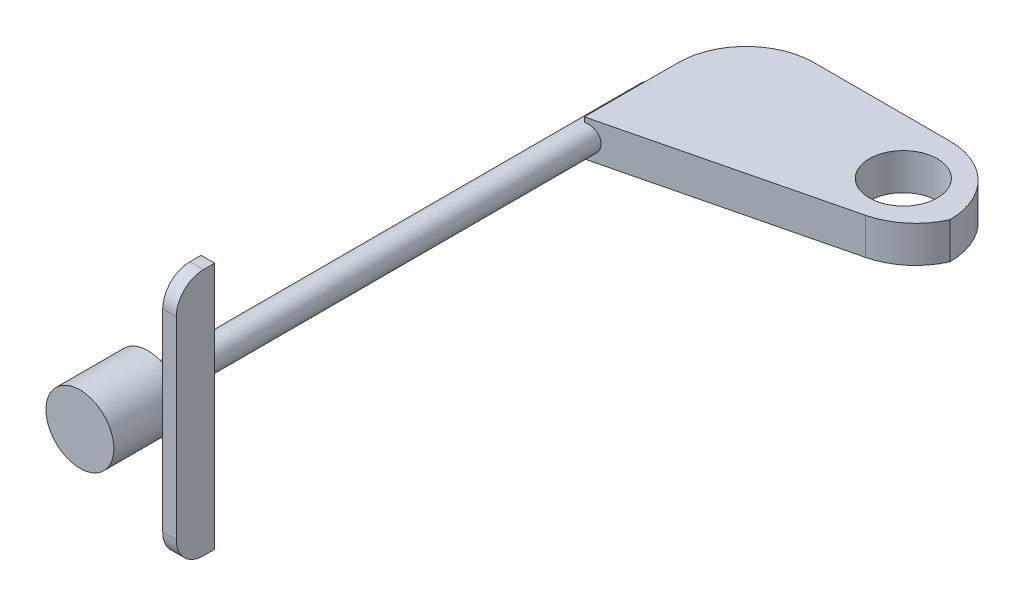
ISO-10303-21;
HEADER;
FILE_DESCRIPTION(('STEP AP214'),'2;1');
FILE_NAME('part.step','',(''),(''),'','','');
FILE_SCHEMA(('AUTOMOTIVE_DESIGN { 1 0 10303 214 1 1 1 1 }'));
ENDSEC;
DATA;
#1=APPLICATION_CONTEXT('core data for automotive mechanical design processes');
#2=APPLICATION_PROTOCOL_DEFINITION('international standard','automotive_design',2000,#1);
#3=PRODUCT_CONTEXT('',#1,'mechanical');
#4=PRODUCT('Part','Part','',(#3));
#5=PRODUCT_RELATED_PRODUCT_CATEGORY('part','',(#4));
#6=PRODUCT_DEFINITION_FORMATION('','',#4);
#7=PRODUCT_DEFINITION_CONTEXT('part definition',#1,'design');
#8=PRODUCT_DEFINITION('design','',#6,#7);
#9=PRODUCT_DEFINITION_SHAPE('','',#8);
#10=(LENGTH_UNIT() NAMED_UNIT(*) SI_UNIT(.MILLI.,.METRE.));
#11=(NAMED_UNIT(*) PLANE_ANGLE_UNIT() SI_UNIT($,.RADIAN.));
#12=(NAMED_UNIT(*) SI_UNIT($,.STERADIAN.) SOLID_ANGLE_UNIT());
#13=UNCERTAINTY_MEASURE_WITH_UNIT(LENGTH_MEASURE(1.E-05),#10,'distance_accuracy_value','');
#14=(GEOMETRIC_REPRESENTATION_CONTEXT(3) GLOBAL_UNCERTAINTY_ASSIGNED_CONTEXT((#13)) GLOBAL_UNIT_ASSIGNED_CONTEXT((#10,
#11,#12)) REPRESENTATION_CONTEXT('',''));
#15=CARTESIAN_POINT('',(0.,0.,0.));
#16=DIRECTION('',(0.,0.,1.));
#17=DIRECTION('',(1.,0.,0.));
#18=AXIS2_PLACEMENT_3D('',#15,#16,#17);
#19=CARTESIAN_POINT('',(3.5,-9.11594568816165,-6.40942583317208));
#20=DIRECTION('',(0.,0.,1.));
#21=DIRECTION('',(-1.,0.,0.));
#22=AXIS2_PLACEMENT_3D('',#19,#20,#21);
#23=PLANE('',#22);
#24=DIRECTION('',(0.,-1.,0.));
#25=VECTOR('',#24,1.);
#26=CARTESIAN_POINT('',(2.5,-9.11594568816165,-6.40942583317208));
#27=LINE('',#26,#25);
#28=CARTESIAN_POINT('',(2.5,9.11594568816165,-6.40942583317208));
#29=VERTEX_POINT('',#28);
#30=CARTESIAN_POINT('',(2.5,-9.11594568816165,-6.40942583317208));
#31=VERTEX_POINT('',#30);
#32=EDGE_CURVE('E129',#29,#31,#27,.T.);
#33=ORIENTED_EDGE('',*,*,#32,.F.);
#34=DIRECTION('',(-1.,0.,0.));
#35=VECTOR('',#34,1.);
#36=CARTESIAN_POINT('',(3.5,9.11594568816165,-6.40942583317208));
#37=LINE('',#36,#35);
#38=CARTESIAN_POINT('',(3.5,9.11594568816165,-6.40942583317208));
#39=VERTEX_POINT('',#38);
#40=EDGE_CURVE('E117',#39,#29,#37,.T.);
#41=ORIENTED_EDGE('',*,*,#40,.F.);
#42=DIRECTION('',(0.,-1.,0.));
#43=VECTOR('',#42,1.);
#44=CARTESIAN_POINT('',(3.5,-9.11594568816165,-6.40942583317208));
#45=LINE('',#44,#43);
#46=CARTESIAN_POINT('',(3.5,-9.11594568816165,-6.40942583317208));
#47=VERTEX_POINT('',#46);
#48=EDGE_CURVE('E100',#39,#47,#45,.T.);
#49=ORIENTED_EDGE('',*,*,#48,.T.);
#50=DIRECTION('',(-1.,0.,0.));
#51=VECTOR('',#50,1.);
#52=CARTESIAN_POINT('',(3.5,-9.11594568816165,-6.40942583317208));
#53=LINE('',#52,#51);
#54=EDGE_CURVE('E109',#47,#31,#53,.T.);
#55=ORIENTED_EDGE('',*,*,#54,.T.);
#56=EDGE_LOOP('',(#33,#41,#49,#55));
#57=FACE_BOUND('',#56,.T.);
#58=ADVANCED_FACE('F45',(#57),#23,.F.);
#59=CARTESIAN_POINT('',(3.5,-9.11594568816165,-3.59057416682792));
#60=DIRECTION('',(0.,1.,0.));
#61=DIRECTION('',(0.,0.,-1.));
#62=AXIS2_PLACEMENT_3D('',#59,#60,#61);
#63=PLANE('',#62);
#64=DIRECTION('',(0.,0.,1.));
#65=VECTOR('',#64,1.);
#66=CARTESIAN_POINT('',(2.5,-9.11594568816165,-3.59057416682792));
#67=LINE('',#66,#65);
#68=CARTESIAN_POINT('',(2.5,-9.11594568816165,-5.59057416682792));
#69=VERTEX_POINT('',#68);
#70=EDGE_CURVE('E112',#31,#69,#67,.T.);
#71=ORIENTED_EDGE('',*,*,#70,.F.);
#72=ORIENTED_EDGE('',*,*,#54,.F.);
#73=DIRECTION('',(0.,0.,1.));
#74=VECTOR('',#73,1.);
#75=CARTESIAN_POINT('',(3.5,-9.11594568816165,-3.59057416682792));
#76=LINE('',#75,#74);
#77=CARTESIAN_POINT('',(3.5,-9.11594568816165,-5.59057416682792));
#78=VERTEX_POINT('',#77);
#79=EDGE_CURVE('E96',#47,#78,#76,.T.);
#80=ORIENTED_EDGE('',*,*,#79,.T.);
#81=DIRECTION('',(-1.,0.,0.));
#82=VECTOR('',#81,1.);
#83=CARTESIAN_POINT('',(3.5,-9.11594568816165,-5.59057416682792));
#84=LINE('',#83,#82);
#85=EDGE_CURVE('E139',#69,#78,#84,.F.);
#86=ORIENTED_EDGE('',*,*,#85,.F.);
#87=EDGE_LOOP('',(#71,#72,#80,#86));
#88=FACE_BOUND('',#87,.T.);
#89=ADVANCED_FACE('F110',(#88),#63,.F.);
#90=CARTESIAN_POINT('',(3.5,-9.11594568816165,-3.59057416682792));
#91=DIRECTION('',(0.,0.,-1.));
#92=DIRECTION('',(1.,0.,0.));
#93=AXIS2_PLACEMENT_3D('',#90,#91,#92);
#94=PLANE('',#93);
#95=DIRECTION('',(0.,1.,0.));
#96=VECTOR('',#95,1.);
#97=CARTESIAN_POINT('',(2.5,-9.11594568816165,-3.59057416682792));
#98=LINE('',#97,#96);
#99=CARTESIAN_POINT('',(2.5,-7.11594568816165,-3.59057416682792));
#100=VERTEX_POINT('',#99);
#101=CARTESIAN_POINT('',(2.5,7.11594568816165,-3.59057416682792));
#102=VERTEX_POINT('',#101);
#103=EDGE_CURVE('E122',#100,#102,#98,.T.);
#104=ORIENTED_EDGE('',*,*,#103,.F.);
#105=DIRECTION('',(-1.,0.,0.));
#106=VECTOR('',#105,1.);
#107=CARTESIAN_POINT('',(3.5,-7.11594568816165,-3.59057416682792));
#108=LINE('',#107,#106);
#109=CARTESIAN_POINT('',(3.5,-7.11594568816165,-3.59057416682792));
#110=VERTEX_POINT('',#109);
#111=EDGE_CURVE('E116',#110,#100,#108,.T.);
#112=ORIENTED_EDGE('',*,*,#111,.F.);
#113=DIRECTION('',(0.,1.,0.));
#114=VECTOR('',#113,1.);
#115=CARTESIAN_POINT('',(3.5,-9.11594568816165,-3.59057416682792));
#116=LINE('',#115,#114);
#117=CARTESIAN_POINT('',(3.5,7.11594568816165,-3.59057416682792));
#118=VERTEX_POINT('',#117);
#119=EDGE_CURVE('E106',#110,#118,#116,.T.);
#120=ORIENTED_EDGE('',*,*,#119,.T.);
#121=DIRECTION('',(-1.,0.,0.));
#122=VECTOR('',#121,1.);
#123=CARTESIAN_POINT('',(3.5,7.11594568816165,-3.59057416682792));
#124=LINE('',#123,#122);
#125=EDGE_CURVE('E53',#102,#118,#124,.F.);
#126=ORIENTED_EDGE('',*,*,#125,.F.);
#127=EDGE_LOOP('',(#104,#112,#120,#126));
#128=FACE_BOUND('',#127,.T.);
#129=ADVANCED_FACE('F148',(#128),#94,.F.);
#130=CARTESIAN_POINT('',(3.5,9.11594568816165,-3.59057416682792));
#131=DIRECTION('',(0.,-1.,0.));
#132=DIRECTION('',(0.,0.,1.));
#133=AXIS2_PLACEMENT_3D('',#130,#131,#132);
#134=PLANE('',#133);
#135=DIRECTION('',(0.,0.,-1.));
#136=VECTOR('',#135,1.);
#137=CARTESIAN_POINT('',(3.5,9.11594568816165,-3.59057416682792));
#138=LINE('',#137,#136);
#139=CARTESIAN_POINT('',(3.5,9.11594568816165,-5.59057416682792));
#140=VERTEX_POINT('',#139);
#141=EDGE_CURVE('E127',#140,#39,#138,.T.);
#142=ORIENTED_EDGE('',*,*,#141,.T.);
#143=ORIENTED_EDGE('',*,*,#40,.T.);
#144=DIRECTION('',(0.,0.,-1.));
#145=VECTOR('',#144,1.);
#146=CARTESIAN_POINT('',(2.5,9.11594568816165,-3.59057416682792));
#147=LINE('',#146,#145);
#148=CARTESIAN_POINT('',(2.5,9.11594568816165,-5.59057416682792));
#149=VERTEX_POINT('',#148);
#150=EDGE_CURVE('E120',#149,#29,#147,.T.);
#151=ORIENTED_EDGE('',*,*,#150,.F.);
#152=DIRECTION('',(-1.,0.,0.));
#153=VECTOR('',#152,1.);
#154=CARTESIAN_POINT('',(3.5,9.11594568816165,-5.59057416682792));
#155=LINE('',#154,#153);
#156=EDGE_CURVE('E142',#140,#149,#155,.T.);
#157=ORIENTED_EDGE('',*,*,#156,.F.);
#158=EDGE_LOOP('',(#142,#143,#151,#157));
#159=FACE_BOUND('',#158,.T.);
#160=ADVANCED_FACE('F155',(#159),#134,.F.);
#161=CARTESIAN_POINT('',(3.5,0.,0.));
#162=DIRECTION('',(1.,0.,0.));
#163=DIRECTION('',(0.,0.,1.));
#164=AXIS2_PLACEMENT_3D('',#161,#162,#163);
#165=PLANE('',#164);
#166=ORIENTED_EDGE('',*,*,#119,.F.);
#167=CARTESIAN_POINT('',(3.5,-7.11594568816165,-5.59057416682792));
#168=DIRECTION('',(-1.,0.,0.));
#169=DIRECTION('',(0.,0.,1.));
#170=AXIS2_PLACEMENT_3D('',#167,#168,#169);
#171=CIRCLE('',#170,2.);
#172=EDGE_CURVE('E102',#78,#110,#171,.T.);
#173=ORIENTED_EDGE('',*,*,#172,.F.);
#174=ORIENTED_EDGE('',*,*,#79,.F.);
#175=ORIENTED_EDGE('',*,*,#48,.F.);
#176=ORIENTED_EDGE('',*,*,#141,.F.);
#177=CARTESIAN_POINT('',(3.5,7.11594568816165,-5.59057416682792));
#178=DIRECTION('',(-1.,0.,0.));
#179=DIRECTION('',(0.,0.,1.));
#180=AXIS2_PLACEMENT_3D('',#177,#178,#179);
#181=CIRCLE('',#180,2.);
#182=EDGE_CURVE('E12',#118,#140,#181,.T.);
#183=ORIENTED_EDGE('',*,*,#182,.F.);
#184=EDGE_LOOP('',(#166,#173,#174,#175,#176,#183));
#185=FACE_BOUND('',#184,.T.);
#186=ADVANCED_FACE('F98',(#185),#165,.T.);
#187=CARTESIAN_POINT('',(2.5,0.,0.));
#188=DIRECTION('',(1.,0.,0.));
#189=DIRECTION('',(0.,0.,1.));
#190=AXIS2_PLACEMENT_3D('',#187,#188,#189);
#191=PLANE('',#190);
#192=ORIENTED_EDGE('',*,*,#150,.T.);
#193=ORIENTED_EDGE('',*,*,#32,.T.);
#194=ORIENTED_EDGE('',*,*,#70,.T.);
#195=CARTESIAN_POINT('',(2.5,-7.11594568816165,-5.59057416682792));
#196=DIRECTION('',(-1.,0.,0.));
#197=DIRECTION('',(0.,0.,1.));
#198=AXIS2_PLACEMENT_3D('',#195,#196,#197);
#199=CIRCLE('',#198,2.);
#200=EDGE_CURVE('E137',#100,#69,#199,.F.);
#201=ORIENTED_EDGE('',*,*,#200,.F.);
#202=ORIENTED_EDGE('',*,*,#103,.T.);
#203=CARTESIAN_POINT('',(2.5,7.11594568816165,-5.59057416682792));
#204=DIRECTION('',(-1.,0.,0.));
#205=DIRECTION('',(0.,0.,1.));
#206=AXIS2_PLACEMENT_3D('',#203,#204,#205);
#207=CIRCLE('',#206,2.);
#208=EDGE_CURVE('E65',#149,#102,#207,.F.);
#209=ORIENTED_EDGE('',*,*,#208,.F.);
#210=EDGE_LOOP('',(#192,#193,#194,#201,#202,#209));
#211=FACE_BOUND('',#210,.T.);
#212=ADVANCED_FACE('F152',(#211),#191,.F.);
#213=CARTESIAN_POINT('',(3.5,-7.11594568816165,-5.59057416682792));
#214=DIRECTION('',(-1.,0.,0.));
#215=DIRECTION('',(0.,0.,-1.));
#216=AXIS2_PLACEMENT_3D('',#213,#214,#215);
#217=CYLINDRICAL_SURFACE('',#216,2.);
#218=ORIENTED_EDGE('',*,*,#172,.T.);
#219=ORIENTED_EDGE('',*,*,#111,.T.);
#220=ORIENTED_EDGE('',*,*,#200,.T.);
#221=ORIENTED_EDGE('',*,*,#85,.T.);
#222=EDGE_LOOP('',(#218,#219,#220,#221));
#223=FACE_BOUND('',#222,.T.);
#224=ADVANCED_FACE('F150',(#223),#217,.T.);
#225=CARTESIAN_POINT('',(3.5,7.11594568816165,-5.59057416682792));
#226=DIRECTION('',(-1.,0.,0.));
#227=DIRECTION('',(0.,0.,-1.));
#228=AXIS2_PLACEMENT_3D('',#225,#226,#227);
#229=CYLINDRICAL_SURFACE('',#228,2.);
#230=ORIENTED_EDGE('',*,*,#182,.T.);
#231=ORIENTED_EDGE('',*,*,#156,.T.);
#232=ORIENTED_EDGE('',*,*,#208,.T.);
#233=ORIENTED_EDGE('',*,*,#125,.T.);
#234=EDGE_LOOP('',(#230,#231,#232,#233));
#235=FACE_BOUND('',#234,.T.);
#236=ADVANCED_FACE('F47',(#235),#229,.T.);
#237=CLOSED_SHELL('',(#58,#89,#129,#160,#186,#212,#224,#236));
#238=MANIFOLD_SOLID_BREP('B2',#237);
#239=CARTESIAN_POINT('',(0.,0.,-5.));
#240=DIRECTION('',(0.,0.,1.));
#241=DIRECTION('',(-1.,0.,0.));
#242=AXIS2_PLACEMENT_3D('',#239,#240,#241);
#243=CYLINDRICAL_SURFACE('',#242,2.5);
#244=CARTESIAN_POINT('',(0.,0.,-5.));
#245=DIRECTION('',(0.,0.,1.));
#246=DIRECTION('',(1.,0.,0.));
#247=AXIS2_PLACEMENT_3D('',#244,#245,#246);
#248=CIRCLE('',#247,2.5);
#249=CARTESIAN_POINT('',(2.5,0.,-5.));
#250=VERTEX_POINT('',#249);
#251=EDGE_CURVE('E322',#250,#250,#248,.T.);
#252=ORIENTED_EDGE('',*,*,#251,.T.);
#253=EDGE_LOOP('',(#252));
#254=FACE_BOUND('',#253,.T.);
#255=CARTESIAN_POINT('',(0.,0.,0.));
#256=DIRECTION('',(0.,0.,1.));
#257=DIRECTION('',(1.,0.,0.));
#258=AXIS2_PLACEMENT_3D('',#255,#256,#257);
#259=CIRCLE('',#258,2.5);
#260=CARTESIAN_POINT('',(2.5,0.,0.));
#261=VERTEX_POINT('',#260);
#262=EDGE_CURVE('E321',#261,#261,#259,.T.);
#263=ORIENTED_EDGE('',*,*,#262,.F.);
#264=EDGE_LOOP('',(#263));
#265=FACE_BOUND('',#264,.T.);
#266=ADVANCED_FACE('F221',(#254,#265),#243,.T.);
#267=CARTESIAN_POINT('',(0.,0.,-5.));
#268=DIRECTION('',(0.,0.,-1.));
#269=DIRECTION('',(1.,0.,0.));
#270=AXIS2_PLACEMENT_3D('',#267,#268,#269);
#271=PLANE('',#270);
#272=CARTESIAN_POINT('',(0.,0.,-5.));
#273=DIRECTION('',(0.,0.,1.));
#274=DIRECTION('',(1.,0.,0.));
#275=AXIS2_PLACEMENT_3D('',#272,#273,#274);
#276=CIRCLE('',#275,0.997360314797742);
#277=CARTESIAN_POINT('',(0.997360314797742,0.,-5.));
#278=VERTEX_POINT('',#277);
#279=EDGE_CURVE('E313',#278,#278,#276,.F.);
#280=ORIENTED_EDGE('',*,*,#279,.F.);
#281=EDGE_LOOP('',(#280));
#282=FACE_BOUND('',#281,.T.);
#283=ORIENTED_EDGE('',*,*,#251,.F.);
#284=EDGE_LOOP('',(#283));
#285=FACE_BOUND('',#284,.T.);
#286=ADVANCED_FACE('F399',(#282,#285),#271,.T.);
#287=CARTESIAN_POINT('',(0.,0.,0.));
#288=DIRECTION('',(0.,0.,-1.));
#289=DIRECTION('',(1.,0.,0.));
#290=AXIS2_PLACEMENT_3D('',#287,#288,#289);
#291=PLANE('',#290);
#292=ORIENTED_EDGE('',*,*,#262,.T.);
#293=EDGE_LOOP('',(#292));
#294=FACE_BOUND('',#293,.T.);
#295=ADVANCED_FACE('F405',(#294),#291,.F.);
#296=CARTESIAN_POINT('',(0.,0.,-42.));
#297=DIRECTION('',(0.,0.,1.));
#298=DIRECTION('',(-1.,0.,0.));
#299=AXIS2_PLACEMENT_3D('',#296,#297,#298);
#300=CYLINDRICAL_SURFACE('',#299,0.997360314797742);
#301=CARTESIAN_POINT('',(0.,0.,-42.));
#302=DIRECTION('',(0.,0.,1.));
#303=DIRECTION('',(1.,0.,0.));
#304=AXIS2_PLACEMENT_3D('',#301,#302,#303);
#305=CIRCLE('',#304,0.997360314797742);
#306=CARTESIAN_POINT('',(0.,0.997360314797743,-42.));
#307=VERTEX_POINT('',#306);
#308=CARTESIAN_POINT('',(0.,-0.997360314797743,-42.));
#309=VERTEX_POINT('',#308);
#310=EDGE_CURVE('E309',#307,#309,#305,.T.);
#311=ORIENTED_EDGE('',*,*,#310,.T.);
#312=DIRECTION('',(0.,0.,1.));
#313=VECTOR('',#312,1.);
#314=CARTESIAN_POINT('',(0.,-0.997360314797741,-42.));
#315=LINE('',#314,#313);
#316=CARTESIAN_POINT('',(0.,-0.997360314797743,-37.1));
#317=VERTEX_POINT('',#316);
#318=EDGE_CURVE('E358',#317,#309,#315,.F.);
#319=ORIENTED_EDGE('',*,*,#318,.F.);
#320=CARTESIAN_POINT('',(0.,0.,-37.1));
#321=DIRECTION('',(-0.237962230135701,0.,-0.971274408717147));
#322=DIRECTION('',(-0.971274408717147,0.,0.237962230135701));
#323=AXIS2_PLACEMENT_3D('',#320,#321,#322);
#324=ELLIPSE('',#323,1.02685740079886,0.997360314797742);
#325=CARTESIAN_POINT('',(0.,0.997360314797743,-37.1));
#326=VERTEX_POINT('',#325);
#327=EDGE_CURVE('E368',#326,#317,#324,.T.);
#328=ORIENTED_EDGE('',*,*,#327,.F.);
#329=DIRECTION('',(0.,0.,1.));
#330=VECTOR('',#329,1.);
#331=CARTESIAN_POINT('',(0.,0.997360314797741,-42.));
#332=LINE('',#331,#330);
#333=EDGE_CURVE('E293',#307,#326,#332,.T.);
#334=ORIENTED_EDGE('',*,*,#333,.F.);
#335=EDGE_LOOP('',(#311,#319,#328,#334));
#336=FACE_BOUND('',#335,.T.);
#337=ORIENTED_EDGE('',*,*,#279,.T.);
#338=EDGE_LOOP('',(#337));
#339=FACE_BOUND('',#338,.T.);
#340=ADVANCED_FACE('F369',(#336,#339),#300,.T.);
#341=CARTESIAN_POINT('',(0.,0.,-42.));
#342=DIRECTION('',(0.,0.,-1.));
#343=DIRECTION('',(1.,0.,0.));
#344=AXIS2_PLACEMENT_3D('',#341,#342,#343);
#345=PLANE('',#344);
#346=DIRECTION('',(0.,-1.,0.));
#347=VECTOR('',#346,1.);
#348=CARTESIAN_POINT('',(0.,-1.34272025295463,-42.));
#349=LINE('',#348,#347);
#350=EDGE_CURVE('E325',#307,#309,#349,.T.);
#351=ORIENTED_EDGE('',*,*,#350,.T.);
#352=ORIENTED_EDGE('',*,*,#310,.F.);
#353=EDGE_LOOP('',(#351,#352));
#354=FACE_BOUND('',#353,.T.);
#355=ADVANCED_FACE('F364',(#354),#345,.T.);
#356=CARTESIAN_POINT('',(0.,1.34272025295463,-49.));
#357=DIRECTION('',(0.,-1.,0.));
#358=DIRECTION('',(0.,0.,1.));
#359=AXIS2_PLACEMENT_3D('',#356,#357,#358);
#360=PLANE('',#359);
#361=CARTESIAN_POINT('',(15.6499435840944,1.34272025295463,-44.9141991384238));
#362=DIRECTION('',(0.,-1.,0.));
#363=DIRECTION('',(0.,0.,-1.));
#364=AXIS2_PLACEMENT_3D('',#361,#362,#363);
#365=CIRCLE('',#364,2.5);
#366=CARTESIAN_POINT('',(15.6499435840944,1.34272025295463,-47.4141991384238));
#367=VERTEX_POINT('',#366);
#368=EDGE_CURVE('E375',#367,#367,#365,.T.);
#369=ORIENTED_EDGE('',*,*,#368,.T.);
#370=EDGE_LOOP('',(#369));
#371=FACE_BOUND('',#370,.T.);
#372=CARTESIAN_POINT('',(15.,1.34272025295463,-44.));
#373=DIRECTION('',(0.,1.,0.));
#374=DIRECTION('',(0.,0.,1.));
#375=AXIS2_PLACEMENT_3D('',#372,#373,#374);
#376=CIRCLE('',#375,5.);
#377=CARTESIAN_POINT('',(15.,1.34272025295463,-49.));
#378=VERTEX_POINT('',#377);
#379=CARTESIAN_POINT('',(20.,1.34272025295463,-44.));
#380=VERTEX_POINT('',#379);
#381=EDGE_CURVE('E330',#378,#380,#376,.F.);
#382=ORIENTED_EDGE('',*,*,#381,.F.);
#383=DIRECTION('',(-1.,0.,0.));
#384=VECTOR('',#383,1.);
#385=CARTESIAN_POINT('',(0.,1.34272025295463,-49.));
#386=LINE('',#385,#384);
#387=CARTESIAN_POINT('',(5.,1.34272025295463,-49.));
#388=VERTEX_POINT('',#387);
#389=EDGE_CURVE('E354',#378,#388,#386,.T.);
#390=ORIENTED_EDGE('',*,*,#389,.T.);
#391=CARTESIAN_POINT('',(5.,1.34272025295463,-44.));
#392=DIRECTION('',(0.,1.,0.));
#393=DIRECTION('',(0.,0.,1.));
#394=AXIS2_PLACEMENT_3D('',#391,#392,#393);
#395=CIRCLE('',#394,5.);
#396=CARTESIAN_POINT('',(0.,1.34272025295463,-44.));
#397=VERTEX_POINT('',#396);
#398=EDGE_CURVE('E308',#397,#388,#395,.F.);
#399=ORIENTED_EDGE('',*,*,#398,.F.);
#400=DIRECTION('',(0.,0.,1.));
#401=VECTOR('',#400,1.);
#402=CARTESIAN_POINT('',(0.,1.34272025295463,-49.));
#403=LINE('',#402,#401);
#404=CARTESIAN_POINT('',(0.,1.34272025295463,-37.1));
#405=VERTEX_POINT('',#404);
#406=EDGE_CURVE('E290',#397,#405,#403,.T.);
#407=ORIENTED_EDGE('',*,*,#406,.T.);
#408=DIRECTION('',(-0.971274408717147,0.,0.237962230135701));
#409=VECTOR('',#408,1.);
#410=CARTESIAN_POINT('',(0.,1.34272025295463,-37.1));
#411=LINE('',#410,#409);
#412=CARTESIAN_POINT('',(16.6196392696128,1.34272025295463,-41.1718116210551));
#413=VERTEX_POINT('',#412);
#414=EDGE_CURVE('E297',#413,#405,#411,.T.);
#415=ORIENTED_EDGE('',*,*,#414,.F.);
#416=CARTESIAN_POINT('',(15.4298281189343,1.34272025295463,-46.0281836646409));
#417=DIRECTION('',(0.,1.,0.));
#418=DIRECTION('',(0.,0.,1.));
#419=AXIS2_PLACEMENT_3D('',#416,#417,#418);
#420=CIRCLE('',#419,5.);
#421=EDGE_CURVE('E345',#380,#413,#420,.F.);
#422=ORIENTED_EDGE('',*,*,#421,.F.);
#423=EDGE_LOOP('',(#382,#390,#399,#407,#415,#422));
#424=FACE_BOUND('',#423,.T.);
#425=ADVANCED_FACE('F305',(#371,#424),#360,.F.);
#426=CARTESIAN_POINT('',(0.,-1.34272025295463,-49.));
#427=DIRECTION('',(1.,0.,0.));
#428=DIRECTION('',(0.,0.,1.));
#429=AXIS2_PLACEMENT_3D('',#426,#427,#428);
#430=PLANE('',#429);
#431=DIRECTION('',(0.,0.,1.));
#432=VECTOR('',#431,1.);
#433=CARTESIAN_POINT('',(0.,-1.34272025295463,-49.));
#434=LINE('',#433,#432);
#435=CARTESIAN_POINT('',(0.,-1.34272025295463,-44.));
#436=VERTEX_POINT('',#435);
#437=CARTESIAN_POINT('',(0.,-1.34272025295463,-37.1));
#438=VERTEX_POINT('',#437);
#439=EDGE_CURVE('E310',#436,#438,#434,.T.);
#440=ORIENTED_EDGE('',*,*,#439,.T.);
#441=DIRECTION('',(0.,1.,0.));
#442=VECTOR('',#441,1.);
#443=CARTESIAN_POINT('',(0.,-21.9342233549625,-37.1));
#444=LINE('',#443,#442);
#445=EDGE_CURVE('E296',#438,#317,#444,.T.);
#446=ORIENTED_EDGE('',*,*,#445,.T.);
#447=ORIENTED_EDGE('',*,*,#318,.T.);
#448=ORIENTED_EDGE('',*,*,#350,.F.);
#449=ORIENTED_EDGE('',*,*,#333,.T.);
#450=EDGE_CURVE('E285',#326,#405,#444,.T.);
#451=ORIENTED_EDGE('',*,*,#450,.T.);
#452=ORIENTED_EDGE('',*,*,#406,.F.);
#453=DIRECTION('',(0.,-1.,0.));
#454=VECTOR('',#453,1.);
#455=CARTESIAN_POINT('',(0.,-1.34272025295463,-44.));
#456=LINE('',#455,#454);
#457=EDGE_CURVE('E342',#436,#397,#456,.F.);
#458=ORIENTED_EDGE('',*,*,#457,.F.);
#459=EDGE_LOOP('',(#440,#446,#447,#448,#449,#451,#452,#458));
#460=FACE_BOUND('',#459,.T.);
#461=ADVANCED_FACE('F287',(#460),#430,.F.);
#462=CARTESIAN_POINT('',(0.,-1.34272025295463,-49.));
#463=DIRECTION('',(0.,1.,0.));
#464=DIRECTION('',(0.,0.,-1.));
#465=AXIS2_PLACEMENT_3D('',#462,#463,#464);
#466=PLANE('',#465);
#467=CARTESIAN_POINT('',(15.6499435840944,-1.34272025295463,-44.9141991384238));
#468=DIRECTION('',(0.,-1.,0.));
#469=DIRECTION('',(0.,0.,-1.));
#470=AXIS2_PLACEMENT_3D('',#467,#468,#469);
#471=CIRCLE('',#470,2.5);
#472=CARTESIAN_POINT('',(15.6499435840944,-1.34272025295463,-47.4141991384238));
#473=VERTEX_POINT('',#472);
#474=EDGE_CURVE('E225',#473,#473,#471,.T.);
#475=ORIENTED_EDGE('',*,*,#474,.F.);
#476=EDGE_LOOP('',(#475));
#477=FACE_BOUND('',#476,.T.);
#478=DIRECTION('',(0.971274408717147,0.,-0.237962230135701));
#479=VECTOR('',#478,1.);
#480=CARTESIAN_POINT('',(0.,-1.34272025295463,-37.1));
#481=LINE('',#480,#479);
#482=CARTESIAN_POINT('',(16.6196392696128,-1.34272025295463,-41.1718116210551));
#483=VERTEX_POINT('',#482);
#484=EDGE_CURVE('E371',#438,#483,#481,.T.);
#485=ORIENTED_EDGE('',*,*,#484,.F.);
#486=ORIENTED_EDGE('',*,*,#439,.F.);
#487=CARTESIAN_POINT('',(5.,-1.34272025295463,-44.));
#488=DIRECTION('',(0.,-1.,0.));
#489=DIRECTION('',(0.,0.,-1.));
#490=AXIS2_PLACEMENT_3D('',#487,#488,#489);
#491=CIRCLE('',#490,5.);
#492=CARTESIAN_POINT('',(5.,-1.34272025295463,-49.));
#493=VERTEX_POINT('',#492);
#494=EDGE_CURVE('E340',#493,#436,#491,.F.);
#495=ORIENTED_EDGE('',*,*,#494,.F.);
#496=DIRECTION('',(1.,0.,0.));
#497=VECTOR('',#496,1.);
#498=CARTESIAN_POINT('',(0.,-1.34272025295463,-49.));
#499=LINE('',#498,#497);
#500=CARTESIAN_POINT('',(15.,-1.34272025295463,-49.));
#501=VERTEX_POINT('',#500);
#502=EDGE_CURVE('E315',#493,#501,#499,.T.);
#503=ORIENTED_EDGE('',*,*,#502,.T.);
#504=CARTESIAN_POINT('',(15.,-1.34272025295463,-44.));
#505=DIRECTION('',(0.,-1.,0.));
#506=DIRECTION('',(0.,0.,-1.));
#507=AXIS2_PLACEMENT_3D('',#504,#505,#506);
#508=CIRCLE('',#507,5.);
#509=CARTESIAN_POINT('',(20.,-1.34272025295463,-44.));
#510=VERTEX_POINT('',#509);
#511=EDGE_CURVE('E335',#510,#501,#508,.F.);
#512=ORIENTED_EDGE('',*,*,#511,.F.);
#513=CARTESIAN_POINT('',(15.4298281189343,-1.34272025295463,-46.0281836646409));
#514=DIRECTION('',(0.,-1.,0.));
#515=DIRECTION('',(0.,0.,-1.));
#516=AXIS2_PLACEMENT_3D('',#513,#514,#515);
#517=CIRCLE('',#516,5.);
#518=EDGE_CURVE('E43',#483,#510,#517,.F.);
#519=ORIENTED_EDGE('',*,*,#518,.F.);
#520=EDGE_LOOP('',(#485,#486,#495,#503,#512,#519));
#521=FACE_BOUND('',#520,.T.);
#522=ADVANCED_FACE('F384',(#477,#521),#466,.F.);
#523=CARTESIAN_POINT('',(0.,0.,-49.));
#524=DIRECTION('',(0.,0.,1.));
#525=DIRECTION('',(-1.,0.,0.));
#526=AXIS2_PLACEMENT_3D('',#523,#524,#525);
#527=PLANE('',#526);
#528=ORIENTED_EDGE('',*,*,#389,.F.);
#529=DIRECTION('',(0.,1.,0.));
#530=VECTOR('',#529,1.);
#531=CARTESIAN_POINT('',(15.,0.,-49.));
#532=LINE('',#531,#530);
#533=EDGE_CURVE('E328',#501,#378,#532,.T.);
#534=ORIENTED_EDGE('',*,*,#533,.F.);
#535=ORIENTED_EDGE('',*,*,#502,.F.);
#536=DIRECTION('',(0.,-1.,0.));
#537=VECTOR('',#536,1.);
#538=CARTESIAN_POINT('',(5.,0.,-49.));
#539=LINE('',#538,#537);
#540=EDGE_CURVE('E338',#388,#493,#539,.T.);
#541=ORIENTED_EDGE('',*,*,#540,.F.);
#542=EDGE_LOOP('',(#528,#534,#535,#541));
#543=FACE_BOUND('',#542,.T.);
#544=ADVANCED_FACE('F355',(#543),#527,.F.);
#545=CARTESIAN_POINT('',(0.,-21.9342233549625,-37.1));
#546=DIRECTION('',(0.237962230135701,0.,0.971274408717147));
#547=DIRECTION('',(-0.971274408717147,0.,0.237962230135701));
#548=AXIS2_PLACEMENT_3D('',#545,#546,#547);
#549=PLANE('',#548);
#550=ORIENTED_EDGE('',*,*,#414,.T.);
#551=ORIENTED_EDGE('',*,*,#450,.F.);
#552=ORIENTED_EDGE('',*,*,#327,.T.);
#553=ORIENTED_EDGE('',*,*,#445,.F.);
#554=ORIENTED_EDGE('',*,*,#484,.T.);
#555=DIRECTION('',(0.,-1.,0.));
#556=VECTOR('',#555,1.);
#557=CARTESIAN_POINT('',(16.6196392696128,-1.34272025295463,-41.1718116210551));
#558=LINE('',#557,#556);
#559=EDGE_CURVE('E230',#413,#483,#558,.T.);
#560=ORIENTED_EDGE('',*,*,#559,.F.);
#561=EDGE_LOOP('',(#550,#551,#552,#553,#554,#560));
#562=FACE_BOUND('',#561,.T.);
#563=ADVANCED_FACE('F300',(#562),#549,.T.);
#564=CARTESIAN_POINT('',(15.,0.,-44.));
#565=DIRECTION('',(0.,1.,0.));
#566=DIRECTION('',(0.,0.,-1.));
#567=AXIS2_PLACEMENT_3D('',#564,#565,#566);
#568=CYLINDRICAL_SURFACE('',#567,5.);
#569=ORIENTED_EDGE('',*,*,#511,.T.);
#570=ORIENTED_EDGE('',*,*,#533,.T.);
#571=ORIENTED_EDGE('',*,*,#381,.T.);
#572=DIRECTION('',(0.,1.,0.));
#573=VECTOR('',#572,1.);
#574=CARTESIAN_POINT('',(20.,-1.34272025295463,-44.));
#575=LINE('',#574,#573);
#576=EDGE_CURVE('E333',#380,#510,#575,.F.);
#577=ORIENTED_EDGE('',*,*,#576,.T.);
#578=EDGE_LOOP('',(#569,#570,#571,#577));
#579=FACE_BOUND('',#578,.T.);
#580=ADVANCED_FACE('F348',(#579),#568,.T.);
#581=CARTESIAN_POINT('',(5.,0.,-44.));
#582=DIRECTION('',(0.,-1.,0.));
#583=DIRECTION('',(0.,0.,1.));
#584=AXIS2_PLACEMENT_3D('',#581,#582,#583);
#585=CYLINDRICAL_SURFACE('',#584,5.);
#586=ORIENTED_EDGE('',*,*,#398,.T.);
#587=ORIENTED_EDGE('',*,*,#540,.T.);
#588=ORIENTED_EDGE('',*,*,#494,.T.);
#589=ORIENTED_EDGE('',*,*,#457,.T.);
#590=EDGE_LOOP('',(#586,#587,#588,#589));
#591=FACE_BOUND('',#590,.T.);
#592=ADVANCED_FACE('F391',(#591),#585,.T.);
#593=CARTESIAN_POINT('',(15.4298281189343,-1.34272025295463,-46.0281836646409));
#594=DIRECTION('',(0.,1.,0.));
#595=DIRECTION('',(0.,0.,-1.));
#596=AXIS2_PLACEMENT_3D('',#593,#594,#595);
#597=CYLINDRICAL_SURFACE('',#596,5.);
#598=ORIENTED_EDGE('',*,*,#518,.T.);
#599=ORIENTED_EDGE('',*,*,#576,.F.);
#600=ORIENTED_EDGE('',*,*,#421,.T.);
#601=ORIENTED_EDGE('',*,*,#559,.T.);
#602=EDGE_LOOP('',(#598,#599,#600,#601));
#603=FACE_BOUND('',#602,.T.);
#604=ADVANCED_FACE('F223',(#603),#597,.T.);
#605=CARTESIAN_POINT('',(15.6499435840944,-8.65727974704537,-44.9141991384238));
#606=DIRECTION('',(0.,1.,0.));
#607=DIRECTION('',(0.,0.,-1.));
#608=AXIS2_PLACEMENT_3D('',#605,#606,#607);
#609=CYLINDRICAL_SURFACE('',#608,2.5);
#610=ORIENTED_EDGE('',*,*,#368,.F.);
#611=EDGE_LOOP('',(#610));
#612=FACE_BOUND('',#611,.T.);
#613=ORIENTED_EDGE('',*,*,#474,.T.);
#614=EDGE_LOOP('',(#613));
#615=FACE_BOUND('',#614,.T.);
#616=ADVANCED_FACE('F382',(#612,#615),#609,.F.);
#617=CLOSED_SHELL('',(#266,#286,#295,#340,#355,#425,#461,#522,#544,#563,#580,#592,#604,#616));
#618=MANIFOLD_SOLID_BREP('B6',#617);
#619=ADVANCED_BREP_SHAPE_REPRESENTATION('',(#18,#238,#618),#14);
#620=SHAPE_DEFINITION_REPRESENTATION(#9,#619);
ENDSEC;
END-ISO-10303-21;
